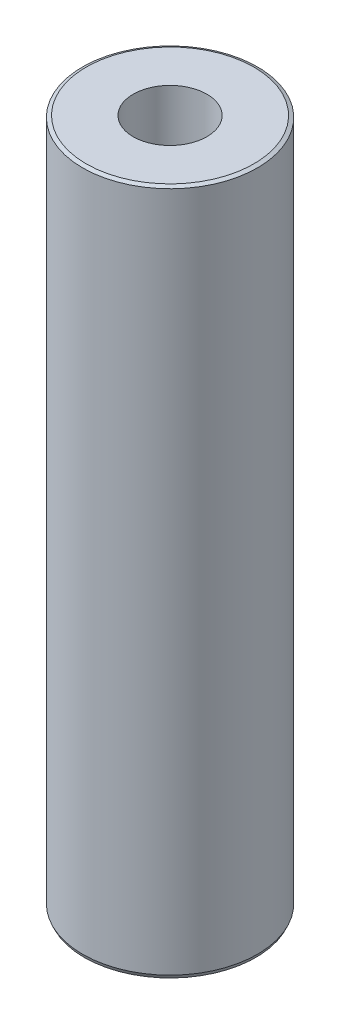
ISO-10303-21;
HEADER;
FILE_DESCRIPTION(('STEP AP214'),'2;1');
FILE_NAME('part.step','',(''),(''),'','','');
FILE_SCHEMA(('AUTOMOTIVE_DESIGN { 1 0 10303 214 1 1 1 1 }'));
ENDSEC;
DATA;
#1=APPLICATION_CONTEXT('core data for automotive mechanical design processes');
#2=APPLICATION_PROTOCOL_DEFINITION('international standard','automotive_design',2000,#1);
#3=PRODUCT_CONTEXT('',#1,'mechanical');
#4=PRODUCT('Part','Part','',(#3));
#5=PRODUCT_RELATED_PRODUCT_CATEGORY('part','',(#4));
#6=PRODUCT_DEFINITION_FORMATION('','',#4);
#7=PRODUCT_DEFINITION_CONTEXT('part definition',#1,'design');
#8=PRODUCT_DEFINITION('design','',#6,#7);
#9=PRODUCT_DEFINITION_SHAPE('','',#8);
#10=(LENGTH_UNIT() NAMED_UNIT(*) SI_UNIT(.MILLI.,.METRE.));
#11=(NAMED_UNIT(*) PLANE_ANGLE_UNIT() SI_UNIT($,.RADIAN.));
#12=(NAMED_UNIT(*) SI_UNIT($,.STERADIAN.) SOLID_ANGLE_UNIT());
#13=UNCERTAINTY_MEASURE_WITH_UNIT(LENGTH_MEASURE(1.E-05),#10,'distance_accuracy_value','');
#14=(GEOMETRIC_REPRESENTATION_CONTEXT(3) GLOBAL_UNCERTAINTY_ASSIGNED_CONTEXT((#13)) GLOBAL_UNIT_ASSIGNED_CONTEXT((#10,
#11,#12)) REPRESENTATION_CONTEXT('',''));
#15=CARTESIAN_POINT('',(0.,0.,0.));
#16=DIRECTION('',(0.,0.,1.));
#17=DIRECTION('',(1.,0.,0.));
#18=AXIS2_PLACEMENT_3D('',#15,#16,#17);
#19=CARTESIAN_POINT('',(0.,451.13194351693,0.));
#20=DIRECTION('',(0.,-1.,0.));
#21=DIRECTION('',(0.,0.,-1.));
#22=AXIS2_PLACEMENT_3D('',#19,#20,#21);
#23=CYLINDRICAL_SURFACE('',#22,57.5);
#24=CARTESIAN_POINT('',(0.,450.045998422751,0.));
#25=DIRECTION('',(0.,1.,0.));
#26=DIRECTION('',(0.,0.,1.));
#27=AXIS2_PLACEMENT_3D('',#24,#25,#26);
#28=CIRCLE('',#27,57.5);
#29=CARTESIAN_POINT('',(0.,450.045998422751,57.5));
#30=VERTEX_POINT('',#29);
#31=EDGE_CURVE('E50',#30,#30,#28,.F.);
#32=ORIENTED_EDGE('',*,*,#31,.T.);
#33=EDGE_LOOP('',(#32));
#34=FACE_BOUND('',#33,.T.);
#35=CARTESIAN_POINT('',(0.,2.3814316182505,0.));
#36=DIRECTION('',(0.,1.,0.));
#37=DIRECTION('',(0.,0.,1.));
#38=AXIS2_PLACEMENT_3D('',#35,#36,#37);
#39=CIRCLE('',#38,57.5);
#40=CARTESIAN_POINT('',(0.,2.3814316182505,57.5));
#41=VERTEX_POINT('',#40);
#42=EDGE_CURVE('E51',#41,#41,#39,.T.);
#43=ORIENTED_EDGE('',*,*,#42,.T.);
#44=EDGE_LOOP('',(#43));
#45=FACE_BOUND('',#44,.T.);
#46=ADVANCED_FACE('F39',(#34,#45),#23,.T.);
#47=CARTESIAN_POINT('',(0.,451.13194351693,0.));
#48=DIRECTION('',(0.,1.,0.));
#49=DIRECTION('',(0.,0.,1.));
#50=AXIS2_PLACEMENT_3D('',#47,#48,#49);
#51=PLANE('',#50);
#52=CARTESIAN_POINT('',(0.,451.13194351693,0.));
#53=DIRECTION('',(0.,1.,0.));
#54=DIRECTION('',(0.,0.,1.));
#55=AXIS2_PLACEMENT_3D('',#52,#53,#54);
#56=CIRCLE('',#55,55.1185683817496);
#57=CARTESIAN_POINT('',(0.,451.13194351693,55.1185683817496));
#58=VERTEX_POINT('',#57);
#59=EDGE_CURVE('E54',#58,#58,#56,.T.);
#60=ORIENTED_EDGE('',*,*,#59,.T.);
#61=EDGE_LOOP('',(#60));
#62=FACE_BOUND('',#61,.T.);
#63=CARTESIAN_POINT('',(0.,451.13194351693,0.));
#64=DIRECTION('',(0.,1.,0.));
#65=DIRECTION('',(0.,0.,1.));
#66=AXIS2_PLACEMENT_3D('',#63,#64,#65);
#67=CIRCLE('',#66,24.2233516491741);
#68=CARTESIAN_POINT('',(0.,451.13194351693,24.2233516491741));
#69=VERTEX_POINT('',#68);
#70=EDGE_CURVE('E58',#69,#69,#67,.T.);
#71=ORIENTED_EDGE('',*,*,#70,.F.);
#72=EDGE_LOOP('',(#71));
#73=FACE_BOUND('',#72,.T.);
#74=ADVANCED_FACE('F69',(#62,#73),#51,.T.);
#75=CARTESIAN_POINT('',(0.,0.,0.));
#76=DIRECTION('',(0.,1.,0.));
#77=DIRECTION('',(0.,0.,1.));
#78=AXIS2_PLACEMENT_3D('',#75,#76,#77);
#79=PLANE('',#78);
#80=CARTESIAN_POINT('',(0.,0.,0.));
#81=DIRECTION('',(0.,1.,0.));
#82=DIRECTION('',(0.,0.,1.));
#83=AXIS2_PLACEMENT_3D('',#80,#81,#82);
#84=CIRCLE('',#83,56.4140549058206);
#85=CARTESIAN_POINT('',(0.,0.,56.4140549058206));
#86=VERTEX_POINT('',#85);
#87=EDGE_CURVE('E10',#86,#86,#84,.F.);
#88=ORIENTED_EDGE('',*,*,#87,.T.);
#89=EDGE_LOOP('',(#88));
#90=FACE_BOUND('',#89,.T.);
#91=CARTESIAN_POINT('',(0.,0.,0.));
#92=DIRECTION('',(0.,1.,0.));
#93=DIRECTION('',(0.,0.,1.));
#94=AXIS2_PLACEMENT_3D('',#91,#92,#93);
#95=CIRCLE('',#94,24.2233516491741);
#96=CARTESIAN_POINT('',(0.,0.,24.2233516491741));
#97=VERTEX_POINT('',#96);
#98=EDGE_CURVE('E63',#97,#97,#95,.T.);
#99=ORIENTED_EDGE('',*,*,#98,.T.);
#100=EDGE_LOOP('',(#99));
#101=FACE_BOUND('',#100,.T.);
#102=ADVANCED_FACE('F75',(#90,#101),#79,.F.);
#103=CARTESIAN_POINT('',(0.,451.13194351693,0.));
#104=DIRECTION('',(0.,-1.,0.));
#105=DIRECTION('',(0.,0.,-1.));
#106=AXIS2_PLACEMENT_3D('',#103,#104,#105);
#107=CYLINDRICAL_SURFACE('',#106,24.2233516491741);
#108=ORIENTED_EDGE('',*,*,#70,.T.);
#109=EDGE_LOOP('',(#108));
#110=FACE_BOUND('',#109,.T.);
#111=ORIENTED_EDGE('',*,*,#98,.F.);
#112=EDGE_LOOP('',(#111));
#113=FACE_BOUND('',#112,.T.);
#114=ADVANCED_FACE('F70',(#110,#113),#107,.F.);
#115=CARTESIAN_POINT('',(0.,451.13194351693,0.));
#116=DIRECTION('',(0.,-1.,0.));
#117=DIRECTION('',(0.,0.,-1.));
#118=AXIS2_PLACEMENT_3D('',#115,#116,#117);
#119=CONICAL_SURFACE('',#118,55.1185683817496,1.14295974737992);
#120=ORIENTED_EDGE('',*,*,#31,.F.);
#121=EDGE_LOOP('',(#120));
#122=FACE_BOUND('',#121,.T.);
#123=ORIENTED_EDGE('',*,*,#59,.F.);
#124=EDGE_LOOP('',(#123));
#125=FACE_BOUND('',#124,.T.);
#126=ADVANCED_FACE('F81',(#122,#125),#119,.T.);
#127=CARTESIAN_POINT('',(0.,2.3814316182505,0.));
#128=DIRECTION('',(0.,1.,0.));
#129=DIRECTION('',(0.,0.,1.));
#130=AXIS2_PLACEMENT_3D('',#127,#128,#129);
#131=CONICAL_SURFACE('',#130,57.5,0.427836579414977);
#132=ORIENTED_EDGE('',*,*,#87,.F.);
#133=EDGE_LOOP('',(#132));
#134=FACE_BOUND('',#133,.T.);
#135=ORIENTED_EDGE('',*,*,#42,.F.);
#136=EDGE_LOOP('',(#135));
#137=FACE_BOUND('',#136,.T.);
#138=ADVANCED_FACE('F45',(#134,#137),#131,.T.);
#139=CLOSED_SHELL('',(#46,#74,#102,#114,#126,#138));
#140=MANIFOLD_SOLID_BREP('B2',#139);
#141=ADVANCED_BREP_SHAPE_REPRESENTATION('',(#18,#140),#14);
#142=SHAPE_DEFINITION_REPRESENTATION(#9,#141);
ENDSEC;
END-ISO-10303-21;
